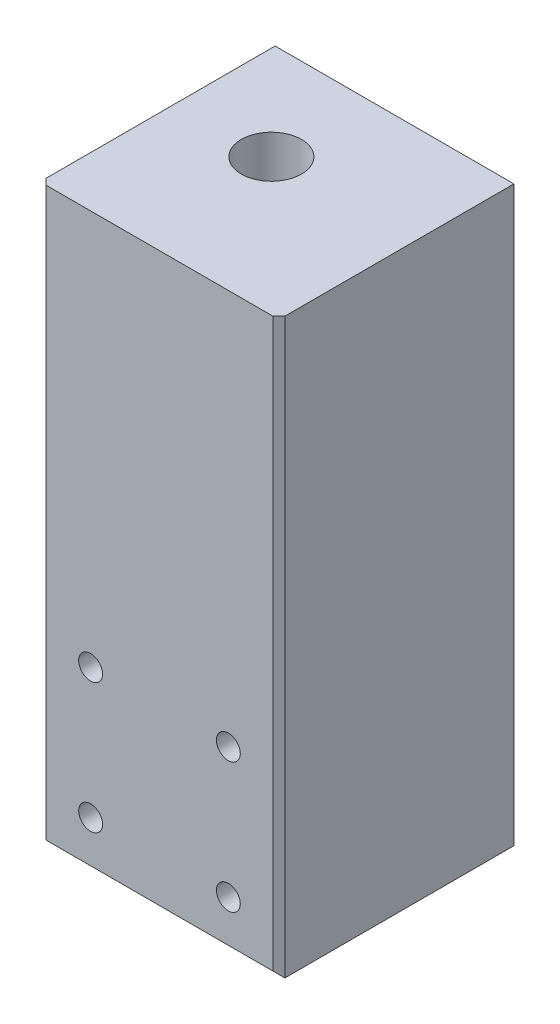
ISO-10303-21;
HEADER;
FILE_DESCRIPTION(('STEP AP214'),'2;1');
FILE_NAME('part.step','',(''),(''),'','','');
FILE_SCHEMA(('AUTOMOTIVE_DESIGN { 1 0 10303 214 1 1 1 1 }'));
ENDSEC;
DATA;
#1=APPLICATION_CONTEXT('core data for automotive mechanical design processes');
#2=APPLICATION_PROTOCOL_DEFINITION('international standard','automotive_design',2000,#1);
#3=PRODUCT_CONTEXT('',#1,'mechanical');
#4=PRODUCT('Part','Part','',(#3));
#5=PRODUCT_RELATED_PRODUCT_CATEGORY('part','',(#4));
#6=PRODUCT_DEFINITION_FORMATION('','',#4);
#7=PRODUCT_DEFINITION_CONTEXT('part definition',#1,'design');
#8=PRODUCT_DEFINITION('design','',#6,#7);
#9=PRODUCT_DEFINITION_SHAPE('','',#8);
#10=(LENGTH_UNIT() NAMED_UNIT(*) SI_UNIT(.MILLI.,.METRE.));
#11=(NAMED_UNIT(*) PLANE_ANGLE_UNIT() SI_UNIT($,.RADIAN.));
#12=(NAMED_UNIT(*) SI_UNIT($,.STERADIAN.) SOLID_ANGLE_UNIT());
#13=UNCERTAINTY_MEASURE_WITH_UNIT(LENGTH_MEASURE(1.E-05),#10,'distance_accuracy_value','');
#14=(GEOMETRIC_REPRESENTATION_CONTEXT(3) GLOBAL_UNCERTAINTY_ASSIGNED_CONTEXT((#13)) GLOBAL_UNIT_ASSIGNED_CONTEXT((#10,
#11,#12)) REPRESENTATION_CONTEXT('',''));
#15=CARTESIAN_POINT('',(0.,0.,0.));
#16=DIRECTION('',(0.,0.,1.));
#17=DIRECTION('',(1.,0.,0.));
#18=AXIS2_PLACEMENT_3D('',#15,#16,#17);
#19=CARTESIAN_POINT('',(-188.874999999999,0.,-25.4));
#20=DIRECTION('',(-1.,0.,0.));
#21=DIRECTION('',(0.,0.,1.));
#22=AXIS2_PLACEMENT_3D('',#19,#20,#21);
#23=PLANE('',#22);
#24=DIRECTION('',(0.,0.,-1.));
#25=VECTOR('',#24,1.);
#26=CARTESIAN_POINT('',(-188.874999999999,0.,-25.4));
#27=LINE('',#26,#25);
#28=CARTESIAN_POINT('',(-188.874999999999,0.,-26.9875));
#29=VERTEX_POINT('',#28);
#30=CARTESIAN_POINT('',(-188.874999999999,0.,-87.9000000000003));
#31=VERTEX_POINT('',#30);
#32=EDGE_CURVE('E92',#29,#31,#27,.T.);
#33=ORIENTED_EDGE('',*,*,#32,.F.);
#34=DIRECTION('',(0.,1.,0.));
#35=VECTOR('',#34,1.);
#36=CARTESIAN_POINT('',(-188.874999999999,0.,-26.9875));
#37=LINE('',#36,#35);
#38=CARTESIAN_POINT('',(-188.874999999999,152.4,-26.9875));
#39=VERTEX_POINT('',#38);
#40=EDGE_CURVE('E11',#29,#39,#37,.T.);
#41=ORIENTED_EDGE('',*,*,#40,.T.);
#42=DIRECTION('',(0.,0.,-1.));
#43=VECTOR('',#42,1.);
#44=CARTESIAN_POINT('',(-188.874999999999,152.4,-25.4));
#45=LINE('',#44,#43);
#46=CARTESIAN_POINT('',(-188.874999999999,152.4,-87.9000000000003));
#47=VERTEX_POINT('',#46);
#48=EDGE_CURVE('E105',#39,#47,#45,.T.);
#49=ORIENTED_EDGE('',*,*,#48,.T.);
#50=DIRECTION('',(0.,1.,0.));
#51=VECTOR('',#50,1.);
#52=CARTESIAN_POINT('',(-188.874999999999,0.,-87.9000000000003));
#53=LINE('',#52,#51);
#54=EDGE_CURVE('E103',#31,#47,#53,.T.);
#55=ORIENTED_EDGE('',*,*,#54,.F.);
#56=EDGE_LOOP('',(#33,#41,#49,#55));
#57=FACE_BOUND('',#56,.T.);
#58=ADVANCED_FACE('F39',(#57),#23,.T.);
#59=CARTESIAN_POINT('',(0.,0.,-25.4));
#60=DIRECTION('',(0.,-1.,0.));
#61=DIRECTION('',(0.,0.,-1.));
#62=AXIS2_PLACEMENT_3D('',#59,#60,#61);
#63=PLANE('',#62);
#64=CARTESIAN_POINT('',(-163.875000000012,0.,-61.9000000000001));
#65=DIRECTION('',(0.,-1.,0.));
#66=DIRECTION('',(0.,0.,-1.));
#67=AXIS2_PLACEMENT_3D('',#64,#65,#66);
#68=CIRCLE('',#67,8.00000000000001);
#69=CARTESIAN_POINT('',(-163.875000000012,0.,-69.9000000000001));
#70=VERTEX_POINT('',#69);
#71=EDGE_CURVE('E336',#70,#70,#68,.T.);
#72=ORIENTED_EDGE('',*,*,#71,.F.);
#73=EDGE_LOOP('',(#72));
#74=FACE_BOUND('',#73,.T.);
#75=CARTESIAN_POINT('',(-163.875000000012,0.,-80.9000000000001));
#76=DIRECTION('',(0.,-1.,0.));
#77=DIRECTION('',(0.,0.,-1.));
#78=AXIS2_PLACEMENT_3D('',#75,#76,#77);
#79=CIRCLE('',#78,2.75);
#80=CARTESIAN_POINT('',(-163.875000000012,0.,-83.6500000000001));
#81=VERTEX_POINT('',#80);
#82=EDGE_CURVE('E348',#81,#81,#79,.T.);
#83=ORIENTED_EDGE('',*,*,#82,.F.);
#84=EDGE_LOOP('',(#83));
#85=FACE_BOUND('',#84,.T.);
#86=CARTESIAN_POINT('',(-177.310028842556,0.,-75.3350288425446));
#87=DIRECTION('',(0.,-1.,0.));
#88=DIRECTION('',(0.,0.,-1.));
#89=AXIS2_PLACEMENT_3D('',#86,#87,#88);
#90=CIRCLE('',#89,2.75000000000003);
#91=CARTESIAN_POINT('',(-177.310028842556,0.,-78.0850288425446));
#92=VERTEX_POINT('',#91);
#93=EDGE_CURVE('E354',#92,#92,#90,.T.);
#94=ORIENTED_EDGE('',*,*,#93,.F.);
#95=EDGE_LOOP('',(#94));
#96=FACE_BOUND('',#95,.T.);
#97=CARTESIAN_POINT('',(-150.439971157467,0.,-48.4649711574556));
#98=DIRECTION('',(0.,-1.,0.));
#99=DIRECTION('',(0.,0.,-1.));
#100=AXIS2_PLACEMENT_3D('',#97,#98,#99);
#101=CIRCLE('',#100,2.75);
#102=CARTESIAN_POINT('',(-150.439971157467,0.,-51.2149711574556));
#103=VERTEX_POINT('',#102);
#104=EDGE_CURVE('E360',#103,#103,#101,.T.);
#105=ORIENTED_EDGE('',*,*,#104,.F.);
#106=EDGE_LOOP('',(#105));
#107=FACE_BOUND('',#106,.T.);
#108=CARTESIAN_POINT('',(-163.875000000012,0.,-42.9000000000001));
#109=DIRECTION('',(0.,-1.,0.));
#110=DIRECTION('',(0.,0.,-1.));
#111=AXIS2_PLACEMENT_3D('',#108,#109,#110);
#112=CIRCLE('',#111,2.75);
#113=CARTESIAN_POINT('',(-163.875000000012,0.,-45.6500000000001));
#114=VERTEX_POINT('',#113);
#115=EDGE_CURVE('E154',#114,#114,#112,.T.);
#116=ORIENTED_EDGE('',*,*,#115,.F.);
#117=EDGE_LOOP('',(#116));
#118=FACE_BOUND('',#117,.T.);
#119=CARTESIAN_POINT('',(-177.310028842556,0.,-48.4649711574556));
#120=DIRECTION('',(0.,-1.,0.));
#121=DIRECTION('',(0.,0.,-1.));
#122=AXIS2_PLACEMENT_3D('',#119,#120,#121);
#123=CIRCLE('',#122,2.75000000000003);
#124=CARTESIAN_POINT('',(-177.310028842556,0.,-51.2149711574556));
#125=VERTEX_POINT('',#124);
#126=EDGE_CURVE('E338',#125,#125,#123,.T.);
#127=ORIENTED_EDGE('',*,*,#126,.F.);
#128=EDGE_LOOP('',(#127));
#129=FACE_BOUND('',#128,.T.);
#130=CARTESIAN_POINT('',(-150.439971157467,0.,-75.3350288425446));
#131=DIRECTION('',(0.,-1.,0.));
#132=DIRECTION('',(0.,0.,-1.));
#133=AXIS2_PLACEMENT_3D('',#130,#131,#132);
#134=CIRCLE('',#133,2.75);
#135=CARTESIAN_POINT('',(-150.439971157467,0.,-78.0850288425446));
#136=VERTEX_POINT('',#135);
#137=EDGE_CURVE('E146',#136,#136,#134,.T.);
#138=ORIENTED_EDGE('',*,*,#137,.F.);
#139=EDGE_LOOP('',(#138));
#140=FACE_BOUND('',#139,.T.);
#141=DIRECTION('',(0.,0.,-1.));
#142=VECTOR('',#141,1.);
#143=CARTESIAN_POINT('',(-125.374999999999,0.,-25.4));
#144=LINE('',#143,#142);
#145=CARTESIAN_POINT('',(-125.374999999999,0.,-26.9875));
#146=VERTEX_POINT('',#145);
#147=CARTESIAN_POINT('',(-125.374999999999,0.,-87.9000000000003));
#148=VERTEX_POINT('',#147);
#149=EDGE_CURVE('E100',#146,#148,#144,.T.);
#150=ORIENTED_EDGE('',*,*,#149,.F.);
#151=DIRECTION('',(-1.,0.,0.));
#152=VECTOR('',#151,1.);
#153=CARTESIAN_POINT('',(0.,0.,-26.9875));
#154=LINE('',#153,#152);
#155=EDGE_CURVE('E49',#146,#29,#154,.T.);
#156=ORIENTED_EDGE('',*,*,#155,.T.);
#157=ORIENTED_EDGE('',*,*,#32,.T.);
#158=DIRECTION('',(-1.,0.,0.));
#159=VECTOR('',#158,1.);
#160=CARTESIAN_POINT('',(0.,0.,-87.9000000000003));
#161=LINE('',#160,#159);
#162=EDGE_CURVE('E96',#148,#31,#161,.T.);
#163=ORIENTED_EDGE('',*,*,#162,.F.);
#164=EDGE_LOOP('',(#150,#156,#157,#163));
#165=FACE_BOUND('',#164,.T.);
#166=ADVANCED_FACE('F94',(#74,#85,#96,#107,#118,#129,#140,#165),#63,.T.);
#167=CARTESIAN_POINT('',(-125.374999999999,0.,-25.4));
#168=DIRECTION('',(-1.,0.,0.));
#169=DIRECTION('',(0.,0.,1.));
#170=AXIS2_PLACEMENT_3D('',#167,#168,#169);
#171=PLANE('',#170);
#172=DIRECTION('',(0.,0.,-1.));
#173=VECTOR('',#172,1.);
#174=CARTESIAN_POINT('',(-125.374999999999,152.4,-25.4));
#175=LINE('',#174,#173);
#176=CARTESIAN_POINT('',(-125.374999999999,152.4,-26.9875));
#177=VERTEX_POINT('',#176);
#178=CARTESIAN_POINT('',(-125.374999999999,152.4,-87.9000000000003));
#179=VERTEX_POINT('',#178);
#180=EDGE_CURVE('E123',#177,#179,#175,.T.);
#181=ORIENTED_EDGE('',*,*,#180,.F.);
#182=DIRECTION('',(0.,-1.,0.));
#183=VECTOR('',#182,1.);
#184=CARTESIAN_POINT('',(-125.374999999999,0.,-26.9875));
#185=LINE('',#184,#183);
#186=EDGE_CURVE('E64',#177,#146,#185,.T.);
#187=ORIENTED_EDGE('',*,*,#186,.T.);
#188=ORIENTED_EDGE('',*,*,#149,.T.);
#189=DIRECTION('',(0.,1.,0.));
#190=VECTOR('',#189,1.);
#191=CARTESIAN_POINT('',(-125.374999999999,0.,-87.9000000000003));
#192=LINE('',#191,#190);
#193=EDGE_CURVE('E114',#148,#179,#192,.T.);
#194=ORIENTED_EDGE('',*,*,#193,.T.);
#195=EDGE_LOOP('',(#181,#187,#188,#194));
#196=FACE_BOUND('',#195,.T.);
#197=ADVANCED_FACE('F220',(#196),#171,.F.);
#198=CARTESIAN_POINT('',(0.,152.4,-25.4));
#199=DIRECTION('',(0.,1.,0.));
#200=DIRECTION('',(0.,0.,1.));
#201=AXIS2_PLACEMENT_3D('',#198,#199,#200);
#202=PLANE('',#201);
#203=CARTESIAN_POINT('',(-163.875000000012,152.4,-61.9000000000001));
#204=DIRECTION('',(0.,-1.,0.));
#205=DIRECTION('',(0.,0.,-1.));
#206=AXIS2_PLACEMENT_3D('',#203,#204,#205);
#207=CIRCLE('',#206,8.00000000000001);
#208=CARTESIAN_POINT('',(-163.875000000012,152.4,-69.9000000000001));
#209=VERTEX_POINT('',#208);
#210=EDGE_CURVE('E333',#209,#209,#207,.T.);
#211=ORIENTED_EDGE('',*,*,#210,.T.);
#212=EDGE_LOOP('',(#211));
#213=FACE_BOUND('',#212,.T.);
#214=DIRECTION('',(1.,0.,0.));
#215=VECTOR('',#214,1.);
#216=CARTESIAN_POINT('',(0.,152.4,-25.4));
#217=LINE('',#216,#215);
#218=CARTESIAN_POINT('',(-187.287499999999,152.4,-25.4));
#219=VERTEX_POINT('',#218);
#220=CARTESIAN_POINT('',(-126.962499999999,152.4,-25.4));
#221=VERTEX_POINT('',#220);
#222=EDGE_CURVE('E121',#219,#221,#217,.T.);
#223=ORIENTED_EDGE('',*,*,#222,.T.);
#224=DIRECTION('',(0.707106781186549,0.,-0.707106781186546));
#225=VECTOR('',#224,1.);
#226=CARTESIAN_POINT('',(-63.4812499999994,152.4,-88.8812499999997));
#227=LINE('',#226,#225);
#228=EDGE_CURVE('E134',#221,#177,#227,.T.);
#229=ORIENTED_EDGE('',*,*,#228,.T.);
#230=ORIENTED_EDGE('',*,*,#180,.T.);
#231=DIRECTION('',(1.,0.,0.));
#232=VECTOR('',#231,1.);
#233=CARTESIAN_POINT('',(0.,152.4,-87.9000000000003));
#234=LINE('',#233,#232);
#235=EDGE_CURVE('E116',#47,#179,#234,.T.);
#236=ORIENTED_EDGE('',*,*,#235,.F.);
#237=ORIENTED_EDGE('',*,*,#48,.F.);
#238=DIRECTION('',(-0.707106781186549,0.,-0.707106781186546));
#239=VECTOR('',#238,1.);
#240=CARTESIAN_POINT('',(-93.6437499999993,152.4,68.2437499999997));
#241=LINE('',#240,#239);
#242=EDGE_CURVE('E132',#39,#219,#241,.F.);
#243=ORIENTED_EDGE('',*,*,#242,.T.);
#244=EDGE_LOOP('',(#223,#229,#230,#236,#237,#243));
#245=FACE_BOUND('',#244,.T.);
#246=ADVANCED_FACE('F193',(#213,#245),#202,.T.);
#247=CARTESIAN_POINT('',(0.,0.,-25.4));
#248=DIRECTION('',(0.,0.,1.));
#249=DIRECTION('',(1.,0.,0.));
#250=AXIS2_PLACEMENT_3D('',#247,#248,#249);
#251=PLANE('',#250);
#252=CARTESIAN_POINT('',(-138.815833333333,12.7,-25.4));
#253=DIRECTION('',(0.,0.,1.));
#254=DIRECTION('',(1.,0.,0.));
#255=AXIS2_PLACEMENT_3D('',#252,#253,#254);
#256=CIRCLE('',#255,3.175);
#257=CARTESIAN_POINT('',(-135.640833333333,12.7,-25.4));
#258=VERTEX_POINT('',#257);
#259=EDGE_CURVE('E172',#258,#258,#256,.T.);
#260=ORIENTED_EDGE('',*,*,#259,.F.);
#261=EDGE_LOOP('',(#260));
#262=FACE_BOUND('',#261,.T.);
#263=CARTESIAN_POINT('',(-175.434166666666,12.7,-25.4));
#264=DIRECTION('',(0.,0.,1.));
#265=DIRECTION('',(1.,0.,0.));
#266=AXIS2_PLACEMENT_3D('',#263,#264,#265);
#267=CIRCLE('',#266,3.175);
#268=CARTESIAN_POINT('',(-172.259166666666,12.7,-25.4));
#269=VERTEX_POINT('',#268);
#270=EDGE_CURVE('E173',#269,#269,#267,.T.);
#271=ORIENTED_EDGE('',*,*,#270,.F.);
#272=EDGE_LOOP('',(#271));
#273=FACE_BOUND('',#272,.T.);
#274=CARTESIAN_POINT('',(-175.434166666666,47.3000000000001,-25.4));
#275=DIRECTION('',(0.,0.,1.));
#276=DIRECTION('',(1.,0.,0.));
#277=AXIS2_PLACEMENT_3D('',#274,#275,#276);
#278=CIRCLE('',#277,3.175);
#279=CARTESIAN_POINT('',(-172.259166666666,47.3000000000001,-25.4));
#280=VERTEX_POINT('',#279);
#281=EDGE_CURVE('E160',#280,#280,#278,.T.);
#282=ORIENTED_EDGE('',*,*,#281,.F.);
#283=EDGE_LOOP('',(#282));
#284=FACE_BOUND('',#283,.T.);
#285=CARTESIAN_POINT('',(-138.815833333333,47.3000000000001,-25.4));
#286=DIRECTION('',(0.,0.,1.));
#287=DIRECTION('',(1.,0.,0.));
#288=AXIS2_PLACEMENT_3D('',#285,#286,#287);
#289=CIRCLE('',#288,3.175);
#290=CARTESIAN_POINT('',(-135.640833333333,47.3000000000001,-25.4));
#291=VERTEX_POINT('',#290);
#292=EDGE_CURVE('E184',#291,#291,#289,.T.);
#293=ORIENTED_EDGE('',*,*,#292,.F.);
#294=EDGE_LOOP('',(#293));
#295=FACE_BOUND('',#294,.T.);
#296=DIRECTION('',(1.,0.,0.));
#297=VECTOR('',#296,1.);
#298=CARTESIAN_POINT('',(0.,1.58750000000003,-25.4));
#299=LINE('',#298,#297);
#300=CARTESIAN_POINT('',(-187.287499999999,1.58750000000003,-25.4));
#301=VERTEX_POINT('',#300);
#302=CARTESIAN_POINT('',(-126.962499999999,1.58750000000003,-25.4));
#303=VERTEX_POINT('',#302);
#304=EDGE_CURVE('E127',#301,#303,#299,.T.);
#305=ORIENTED_EDGE('',*,*,#304,.T.);
#306=DIRECTION('',(0.,1.,0.));
#307=VECTOR('',#306,1.);
#308=CARTESIAN_POINT('',(-126.962499999999,152.4,-25.4));
#309=LINE('',#308,#307);
#310=EDGE_CURVE('E129',#303,#221,#309,.T.);
#311=ORIENTED_EDGE('',*,*,#310,.T.);
#312=ORIENTED_EDGE('',*,*,#222,.F.);
#313=DIRECTION('',(0.,-1.,0.));
#314=VECTOR('',#313,1.);
#315=CARTESIAN_POINT('',(-187.287499999999,0.,-25.4));
#316=LINE('',#315,#314);
#317=EDGE_CURVE('E99',#219,#301,#316,.T.);
#318=ORIENTED_EDGE('',*,*,#317,.T.);
#319=EDGE_LOOP('',(#305,#311,#312,#318));
#320=FACE_BOUND('',#319,.T.);
#321=ADVANCED_FACE('F197',(#262,#273,#284,#295,#320),#251,.T.);
#322=CARTESIAN_POINT('',(0.,0.,-87.9000000000003));
#323=DIRECTION('',(0.,0.,1.));
#324=DIRECTION('',(1.,0.,0.));
#325=AXIS2_PLACEMENT_3D('',#322,#323,#324);
#326=PLANE('',#325);
#327=CARTESIAN_POINT('',(-138.815833333333,47.3000000000001,-87.9000000000003));
#328=DIRECTION('',(0.,0.,1.));
#329=DIRECTION('',(1.,0.,0.));
#330=AXIS2_PLACEMENT_3D('',#327,#328,#329);
#331=CIRCLE('',#330,3.175);
#332=CARTESIAN_POINT('',(-135.640833333333,47.3000000000001,-87.9000000000003));
#333=VERTEX_POINT('',#332);
#334=EDGE_CURVE('E161',#333,#333,#331,.T.);
#335=ORIENTED_EDGE('',*,*,#334,.T.);
#336=EDGE_LOOP('',(#335));
#337=FACE_BOUND('',#336,.T.);
#338=CARTESIAN_POINT('',(-138.815833333333,12.7,-87.9000000000003));
#339=DIRECTION('',(0.,0.,1.));
#340=DIRECTION('',(1.,0.,0.));
#341=AXIS2_PLACEMENT_3D('',#338,#339,#340);
#342=CIRCLE('',#341,3.175);
#343=CARTESIAN_POINT('',(-135.640833333333,12.7,-87.9000000000003));
#344=VERTEX_POINT('',#343);
#345=EDGE_CURVE('E144',#344,#344,#342,.T.);
#346=ORIENTED_EDGE('',*,*,#345,.T.);
#347=EDGE_LOOP('',(#346));
#348=FACE_BOUND('',#347,.T.);
#349=ORIENTED_EDGE('',*,*,#54,.T.);
#350=ORIENTED_EDGE('',*,*,#235,.T.);
#351=ORIENTED_EDGE('',*,*,#193,.F.);
#352=ORIENTED_EDGE('',*,*,#162,.T.);
#353=EDGE_LOOP('',(#349,#350,#351,#352));
#354=FACE_BOUND('',#353,.T.);
#355=ADVANCED_FACE('F112',(#337,#348,#354),#326,.F.);
#356=CARTESIAN_POINT('',(-138.815833333333,47.3000000000001,-50.8));
#357=DIRECTION('',(0.,0.,1.));
#358=DIRECTION('',(1.,0.,0.));
#359=AXIS2_PLACEMENT_3D('',#356,#357,#358);
#360=CYLINDRICAL_SURFACE('',#359,3.175);
#361=CARTESIAN_POINT('',(-138.815833333333,47.3000000000001,-50.8));
#362=DIRECTION('',(0.,0.,1.));
#363=DIRECTION('',(1.,0.,0.));
#364=AXIS2_PLACEMENT_3D('',#361,#362,#363);
#365=CIRCLE('',#364,3.175);
#366=CARTESIAN_POINT('',(-135.640833333333,47.3000000000001,-50.8));
#367=VERTEX_POINT('',#366);
#368=EDGE_CURVE('E109',#367,#367,#365,.T.);
#369=ORIENTED_EDGE('',*,*,#368,.F.);
#370=EDGE_LOOP('',(#369));
#371=FACE_BOUND('',#370,.T.);
#372=ORIENTED_EDGE('',*,*,#292,.T.);
#373=EDGE_LOOP('',(#372));
#374=FACE_BOUND('',#373,.T.);
#375=ADVANCED_FACE('F231',(#371,#374),#360,.F.);
#376=CARTESIAN_POINT('',(-138.815833333333,47.3000000000001,-50.8));
#377=DIRECTION('',(0.,0.,1.));
#378=DIRECTION('',(1.,0.,0.));
#379=AXIS2_PLACEMENT_3D('',#376,#377,#378);
#380=PLANE('',#379);
#381=ORIENTED_EDGE('',*,*,#368,.T.);
#382=EDGE_LOOP('',(#381));
#383=FACE_BOUND('',#382,.T.);
#384=ADVANCED_FACE('F238',(#383),#380,.T.);
#385=CARTESIAN_POINT('',(-175.434166666666,47.3000000000001,-50.8));
#386=DIRECTION('',(0.,0.,1.));
#387=DIRECTION('',(1.,0.,0.));
#388=AXIS2_PLACEMENT_3D('',#385,#386,#387);
#389=CYLINDRICAL_SURFACE('',#388,3.175);
#390=CARTESIAN_POINT('',(-175.434166666666,47.3000000000001,-50.8));
#391=DIRECTION('',(0.,0.,1.));
#392=DIRECTION('',(1.,0.,0.));
#393=AXIS2_PLACEMENT_3D('',#390,#391,#392);
#394=CIRCLE('',#393,3.175);
#395=CARTESIAN_POINT('',(-172.259166666666,47.3000000000001,-50.8));
#396=VERTEX_POINT('',#395);
#397=EDGE_CURVE('E176',#396,#396,#394,.T.);
#398=ORIENTED_EDGE('',*,*,#397,.F.);
#399=EDGE_LOOP('',(#398));
#400=FACE_BOUND('',#399,.T.);
#401=ORIENTED_EDGE('',*,*,#281,.T.);
#402=EDGE_LOOP('',(#401));
#403=FACE_BOUND('',#402,.T.);
#404=ADVANCED_FACE('F242',(#400,#403),#389,.F.);
#405=CARTESIAN_POINT('',(-175.434166666666,47.3000000000001,-50.8));
#406=DIRECTION('',(0.,0.,1.));
#407=DIRECTION('',(1.,0.,0.));
#408=AXIS2_PLACEMENT_3D('',#405,#406,#407);
#409=PLANE('',#408);
#410=ORIENTED_EDGE('',*,*,#397,.T.);
#411=EDGE_LOOP('',(#410));
#412=FACE_BOUND('',#411,.T.);
#413=ADVANCED_FACE('F256',(#412),#409,.T.);
#414=CARTESIAN_POINT('',(-175.434166666666,12.7,-50.8));
#415=DIRECTION('',(0.,0.,1.));
#416=DIRECTION('',(1.,0.,0.));
#417=AXIS2_PLACEMENT_3D('',#414,#415,#416);
#418=CYLINDRICAL_SURFACE('',#417,3.175);
#419=CARTESIAN_POINT('',(-175.434166666666,12.7,-50.8));
#420=DIRECTION('',(0.,0.,1.));
#421=DIRECTION('',(1.,0.,0.));
#422=AXIS2_PLACEMENT_3D('',#419,#420,#421);
#423=CIRCLE('',#422,3.175);
#424=CARTESIAN_POINT('',(-172.259166666666,12.7,-50.8));
#425=VERTEX_POINT('',#424);
#426=EDGE_CURVE('E169',#425,#425,#423,.T.);
#427=ORIENTED_EDGE('',*,*,#426,.F.);
#428=EDGE_LOOP('',(#427));
#429=FACE_BOUND('',#428,.T.);
#430=ORIENTED_EDGE('',*,*,#270,.T.);
#431=EDGE_LOOP('',(#430));
#432=FACE_BOUND('',#431,.T.);
#433=ADVANCED_FACE('F260',(#429,#432),#418,.F.);
#434=CARTESIAN_POINT('',(-175.434166666666,12.7,-50.8));
#435=DIRECTION('',(0.,0.,1.));
#436=DIRECTION('',(1.,0.,0.));
#437=AXIS2_PLACEMENT_3D('',#434,#435,#436);
#438=PLANE('',#437);
#439=ORIENTED_EDGE('',*,*,#426,.T.);
#440=EDGE_LOOP('',(#439));
#441=FACE_BOUND('',#440,.T.);
#442=ADVANCED_FACE('F248',(#441),#438,.T.);
#443=CARTESIAN_POINT('',(-138.815833333333,12.7,-50.8));
#444=DIRECTION('',(0.,0.,1.));
#445=DIRECTION('',(1.,0.,0.));
#446=AXIS2_PLACEMENT_3D('',#443,#444,#445);
#447=CYLINDRICAL_SURFACE('',#446,3.175);
#448=CARTESIAN_POINT('',(-138.815833333333,12.7,-50.8));
#449=DIRECTION('',(0.,0.,1.));
#450=DIRECTION('',(1.,0.,0.));
#451=AXIS2_PLACEMENT_3D('',#448,#449,#450);
#452=CIRCLE('',#451,3.175);
#453=CARTESIAN_POINT('',(-135.640833333333,12.7,-50.8));
#454=VERTEX_POINT('',#453);
#455=EDGE_CURVE('E181',#454,#454,#452,.T.);
#456=ORIENTED_EDGE('',*,*,#455,.F.);
#457=EDGE_LOOP('',(#456));
#458=FACE_BOUND('',#457,.T.);
#459=ORIENTED_EDGE('',*,*,#259,.T.);
#460=EDGE_LOOP('',(#459));
#461=FACE_BOUND('',#460,.T.);
#462=ADVANCED_FACE('F244',(#458,#461),#447,.F.);
#463=CARTESIAN_POINT('',(-138.815833333333,12.7,-50.8));
#464=DIRECTION('',(0.,0.,1.));
#465=DIRECTION('',(1.,0.,0.));
#466=AXIS2_PLACEMENT_3D('',#463,#464,#465);
#467=PLANE('',#466);
#468=ORIENTED_EDGE('',*,*,#455,.T.);
#469=EDGE_LOOP('',(#468));
#470=FACE_BOUND('',#469,.T.);
#471=ADVANCED_FACE('F247',(#470),#467,.T.);
#472=CARTESIAN_POINT('',(-138.815833333333,12.7,-81.5500000000003));
#473=DIRECTION('',(0.,0.,-1.));
#474=DIRECTION('',(-1.,0.,0.));
#475=AXIS2_PLACEMENT_3D('',#472,#473,#474);
#476=CYLINDRICAL_SURFACE('',#475,3.175);
#477=CARTESIAN_POINT('',(-138.815833333333,12.7,-81.5500000000003));
#478=DIRECTION('',(0.,0.,1.));
#479=DIRECTION('',(1.,0.,0.));
#480=AXIS2_PLACEMENT_3D('',#477,#478,#479);
#481=CIRCLE('',#480,3.175);
#482=CARTESIAN_POINT('',(-135.640833333333,12.7,-81.5500000000003));
#483=VERTEX_POINT('',#482);
#484=EDGE_CURVE('E164',#483,#483,#481,.T.);
#485=ORIENTED_EDGE('',*,*,#484,.T.);
#486=EDGE_LOOP('',(#485));
#487=FACE_BOUND('',#486,.T.);
#488=ORIENTED_EDGE('',*,*,#345,.F.);
#489=EDGE_LOOP('',(#488));
#490=FACE_BOUND('',#489,.T.);
#491=ADVANCED_FACE('F252',(#487,#490),#476,.F.);
#492=CARTESIAN_POINT('',(-138.815833333333,12.7,-81.5500000000003));
#493=DIRECTION('',(0.,0.,1.));
#494=DIRECTION('',(1.,0.,0.));
#495=AXIS2_PLACEMENT_3D('',#492,#493,#494);
#496=PLANE('',#495);
#497=ORIENTED_EDGE('',*,*,#484,.F.);
#498=EDGE_LOOP('',(#497));
#499=FACE_BOUND('',#498,.T.);
#500=ADVANCED_FACE('F270',(#499),#496,.F.);
#501=CARTESIAN_POINT('',(-138.815833333333,47.3000000000001,-81.5500000000003));
#502=DIRECTION('',(0.,0.,-1.));
#503=DIRECTION('',(-1.,0.,0.));
#504=AXIS2_PLACEMENT_3D('',#501,#502,#503);
#505=CYLINDRICAL_SURFACE('',#504,3.175);
#506=CARTESIAN_POINT('',(-138.815833333333,47.3000000000001,-81.5500000000003));
#507=DIRECTION('',(0.,0.,1.));
#508=DIRECTION('',(1.,0.,0.));
#509=AXIS2_PLACEMENT_3D('',#506,#507,#508);
#510=CIRCLE('',#509,3.175);
#511=CARTESIAN_POINT('',(-135.640833333333,47.3000000000001,-81.5500000000003));
#512=VERTEX_POINT('',#511);
#513=EDGE_CURVE('E157',#512,#512,#510,.T.);
#514=ORIENTED_EDGE('',*,*,#513,.T.);
#515=EDGE_LOOP('',(#514));
#516=FACE_BOUND('',#515,.T.);
#517=ORIENTED_EDGE('',*,*,#334,.F.);
#518=EDGE_LOOP('',(#517));
#519=FACE_BOUND('',#518,.T.);
#520=ADVANCED_FACE('F274',(#516,#519),#505,.F.);
#521=CARTESIAN_POINT('',(-138.815833333333,47.3000000000001,-81.5500000000003));
#522=DIRECTION('',(0.,0.,1.));
#523=DIRECTION('',(1.,0.,0.));
#524=AXIS2_PLACEMENT_3D('',#521,#522,#523);
#525=PLANE('',#524);
#526=ORIENTED_EDGE('',*,*,#513,.F.);
#527=EDGE_LOOP('',(#526));
#528=FACE_BOUND('',#527,.T.);
#529=ADVANCED_FACE('F278',(#528),#525,.F.);
#530=CARTESIAN_POINT('',(-188.874999999999,0.,-26.9875));
#531=DIRECTION('',(0.707106781186546,0.,-0.707106781186549));
#532=DIRECTION('',(0.,1.,0.));
#533=AXIS2_PLACEMENT_3D('',#530,#531,#532);
#534=PLANE('',#533);
#535=ORIENTED_EDGE('',*,*,#242,.F.);
#536=ORIENTED_EDGE('',*,*,#40,.F.);
#537=DIRECTION('',(0.577350269189626,0.577350269189629,0.577350269189623));
#538=VECTOR('',#537,1.);
#539=CARTESIAN_POINT('',(-188.874999999999,0.,-26.9875));
#540=LINE('',#539,#538);
#541=EDGE_CURVE('E44',#301,#29,#540,.F.);
#542=ORIENTED_EDGE('',*,*,#541,.F.);
#543=ORIENTED_EDGE('',*,*,#317,.F.);
#544=EDGE_LOOP('',(#535,#536,#542,#543));
#545=FACE_BOUND('',#544,.T.);
#546=ADVANCED_FACE('F42',(#545),#534,.F.);
#547=CARTESIAN_POINT('',(0.,0.,-26.9875));
#548=DIRECTION('',(0.,0.707106781186544,-0.707106781186551));
#549=DIRECTION('',(-1.,0.,0.));
#550=AXIS2_PLACEMENT_3D('',#547,#548,#549);
#551=PLANE('',#550);
#552=ORIENTED_EDGE('',*,*,#541,.T.);
#553=ORIENTED_EDGE('',*,*,#155,.F.);
#554=DIRECTION('',(0.577350269189626,-0.577350269189629,-0.577350269189623));
#555=VECTOR('',#554,1.);
#556=CARTESIAN_POINT('',(-83.5833333333329,-41.7916666666667,-68.7791666666663));
#557=LINE('',#556,#555);
#558=EDGE_CURVE('E137',#303,#146,#557,.T.);
#559=ORIENTED_EDGE('',*,*,#558,.F.);
#560=ORIENTED_EDGE('',*,*,#304,.F.);
#561=EDGE_LOOP('',(#552,#553,#559,#560));
#562=FACE_BOUND('',#561,.T.);
#563=ADVANCED_FACE('F202',(#562),#551,.F.);
#564=CARTESIAN_POINT('',(-126.962499999999,0.,-25.4));
#565=DIRECTION('',(0.707106781186546,0.,0.707106781186549));
#566=DIRECTION('',(0.,-1.,0.));
#567=AXIS2_PLACEMENT_3D('',#564,#565,#566);
#568=PLANE('',#567);
#569=ORIENTED_EDGE('',*,*,#558,.T.);
#570=ORIENTED_EDGE('',*,*,#186,.F.);
#571=ORIENTED_EDGE('',*,*,#228,.F.);
#572=ORIENTED_EDGE('',*,*,#310,.F.);
#573=EDGE_LOOP('',(#569,#570,#571,#572));
#574=FACE_BOUND('',#573,.T.);
#575=ADVANCED_FACE('F203',(#574),#568,.T.);
#576=CARTESIAN_POINT('',(-150.439971157467,6.35,-75.3350288425446));
#577=DIRECTION('',(0.,-1.,0.));
#578=DIRECTION('',(0.,0.,-1.));
#579=AXIS2_PLACEMENT_3D('',#576,#577,#578);
#580=CYLINDRICAL_SURFACE('',#579,2.75);
#581=CARTESIAN_POINT('',(-150.439971157467,6.35,-75.3350288425446));
#582=DIRECTION('',(0.,-1.,0.));
#583=DIRECTION('',(0.,0.,-1.));
#584=AXIS2_PLACEMENT_3D('',#581,#582,#583);
#585=CIRCLE('',#584,2.75);
#586=CARTESIAN_POINT('',(-150.439971157467,6.35,-78.0850288425446));
#587=VERTEX_POINT('',#586);
#588=EDGE_CURVE('E139',#587,#587,#585,.T.);
#589=ORIENTED_EDGE('',*,*,#588,.F.);
#590=EDGE_LOOP('',(#589));
#591=FACE_BOUND('',#590,.T.);
#592=ORIENTED_EDGE('',*,*,#137,.T.);
#593=EDGE_LOOP('',(#592));
#594=FACE_BOUND('',#593,.T.);
#595=ADVANCED_FACE('F205',(#591,#594),#580,.F.);
#596=CARTESIAN_POINT('',(0.,6.35,0.));
#597=DIRECTION('',(0.,-1.,0.));
#598=DIRECTION('',(0.,0.,-1.));
#599=AXIS2_PLACEMENT_3D('',#596,#597,#598);
#600=PLANE('',#599);
#601=ORIENTED_EDGE('',*,*,#588,.T.);
#602=EDGE_LOOP('',(#601));
#603=FACE_BOUND('',#602,.T.);
#604=ADVANCED_FACE('F211',(#603),#600,.T.);
#605=CARTESIAN_POINT('',(-177.310028842556,6.35,-48.4649711574556));
#606=DIRECTION('',(0.,-1.,0.));
#607=DIRECTION('',(0.,0.,-1.));
#608=AXIS2_PLACEMENT_3D('',#605,#606,#607);
#609=CYLINDRICAL_SURFACE('',#608,2.75000000000003);
#610=CARTESIAN_POINT('',(-177.310028842556,6.35,-48.4649711574556));
#611=DIRECTION('',(0.,-1.,0.));
#612=DIRECTION('',(0.,0.,-1.));
#613=AXIS2_PLACEMENT_3D('',#610,#611,#612);
#614=CIRCLE('',#613,2.75000000000003);
#615=CARTESIAN_POINT('',(-177.310028842556,6.35,-51.2149711574556));
#616=VERTEX_POINT('',#615);
#617=EDGE_CURVE('E341',#616,#616,#614,.T.);
#618=ORIENTED_EDGE('',*,*,#617,.F.);
#619=EDGE_LOOP('',(#618));
#620=FACE_BOUND('',#619,.T.);
#621=ORIENTED_EDGE('',*,*,#126,.T.);
#622=EDGE_LOOP('',(#621));
#623=FACE_BOUND('',#622,.T.);
#624=ADVANCED_FACE('F285',(#620,#623),#609,.F.);
#625=CARTESIAN_POINT('',(0.,6.35,0.));
#626=DIRECTION('',(0.,-1.,0.));
#627=DIRECTION('',(0.,0.,-1.));
#628=AXIS2_PLACEMENT_3D('',#625,#626,#627);
#629=PLANE('',#628);
#630=ORIENTED_EDGE('',*,*,#617,.T.);
#631=EDGE_LOOP('',(#630));
#632=FACE_BOUND('',#631,.T.);
#633=ADVANCED_FACE('F290',(#632),#629,.T.);
#634=CARTESIAN_POINT('',(-163.875000000012,6.35,-42.9000000000001));
#635=DIRECTION('',(0.,-1.,0.));
#636=DIRECTION('',(0.,0.,-1.));
#637=AXIS2_PLACEMENT_3D('',#634,#635,#636);
#638=CYLINDRICAL_SURFACE('',#637,2.75);
#639=CARTESIAN_POINT('',(-163.875000000012,6.35,-42.9000000000001));
#640=DIRECTION('',(0.,-1.,0.));
#641=DIRECTION('',(0.,0.,-1.));
#642=AXIS2_PLACEMENT_3D('',#639,#640,#641);
#643=CIRCLE('',#642,2.75);
#644=CARTESIAN_POINT('',(-163.875000000012,6.35,-45.6500000000001));
#645=VERTEX_POINT('',#644);
#646=EDGE_CURVE('E362',#645,#645,#643,.T.);
#647=ORIENTED_EDGE('',*,*,#646,.F.);
#648=EDGE_LOOP('',(#647));
#649=FACE_BOUND('',#648,.T.);
#650=ORIENTED_EDGE('',*,*,#115,.T.);
#651=EDGE_LOOP('',(#650));
#652=FACE_BOUND('',#651,.T.);
#653=ADVANCED_FACE('F286',(#649,#652),#638,.F.);
#654=CARTESIAN_POINT('',(0.,6.35,0.));
#655=DIRECTION('',(0.,-1.,0.));
#656=DIRECTION('',(0.,0.,-1.));
#657=AXIS2_PLACEMENT_3D('',#654,#655,#656);
#658=PLANE('',#657);
#659=ORIENTED_EDGE('',*,*,#646,.T.);
#660=EDGE_LOOP('',(#659));
#661=FACE_BOUND('',#660,.T.);
#662=ADVANCED_FACE('F289',(#661),#658,.T.);
#663=CARTESIAN_POINT('',(-150.439971157467,6.35,-48.4649711574556));
#664=DIRECTION('',(0.,-1.,0.));
#665=DIRECTION('',(0.,0.,-1.));
#666=AXIS2_PLACEMENT_3D('',#663,#664,#665);
#667=CYLINDRICAL_SURFACE('',#666,2.75);
#668=CARTESIAN_POINT('',(-150.439971157467,6.35,-48.4649711574556));
#669=DIRECTION('',(0.,-1.,0.));
#670=DIRECTION('',(0.,0.,-1.));
#671=AXIS2_PLACEMENT_3D('',#668,#669,#670);
#672=CIRCLE('',#671,2.75);
#673=CARTESIAN_POINT('',(-150.439971157467,6.35,-51.2149711574556));
#674=VERTEX_POINT('',#673);
#675=EDGE_CURVE('E357',#674,#674,#672,.T.);
#676=ORIENTED_EDGE('',*,*,#675,.F.);
#677=EDGE_LOOP('',(#676));
#678=FACE_BOUND('',#677,.T.);
#679=ORIENTED_EDGE('',*,*,#104,.T.);
#680=EDGE_LOOP('',(#679));
#681=FACE_BOUND('',#680,.T.);
#682=ADVANCED_FACE('F294',(#678,#681),#667,.F.);
#683=CARTESIAN_POINT('',(0.,6.35,0.));
#684=DIRECTION('',(0.,-1.,0.));
#685=DIRECTION('',(0.,0.,-1.));
#686=AXIS2_PLACEMENT_3D('',#683,#684,#685);
#687=PLANE('',#686);
#688=ORIENTED_EDGE('',*,*,#675,.T.);
#689=EDGE_LOOP('',(#688));
#690=FACE_BOUND('',#689,.T.);
#691=ADVANCED_FACE('F298',(#690),#687,.T.);
#692=CARTESIAN_POINT('',(-177.310028842556,6.35,-75.3350288425446));
#693=DIRECTION('',(0.,-1.,0.));
#694=DIRECTION('',(0.,0.,-1.));
#695=AXIS2_PLACEMENT_3D('',#692,#693,#694);
#696=CYLINDRICAL_SURFACE('',#695,2.75000000000003);
#697=CARTESIAN_POINT('',(-177.310028842556,6.35,-75.3350288425446));
#698=DIRECTION('',(0.,-1.,0.));
#699=DIRECTION('',(0.,0.,-1.));
#700=AXIS2_PLACEMENT_3D('',#697,#698,#699);
#701=CIRCLE('',#700,2.75000000000003);
#702=CARTESIAN_POINT('',(-177.310028842556,6.35,-78.0850288425446));
#703=VERTEX_POINT('',#702);
#704=EDGE_CURVE('E351',#703,#703,#701,.T.);
#705=ORIENTED_EDGE('',*,*,#704,.F.);
#706=EDGE_LOOP('',(#705));
#707=FACE_BOUND('',#706,.T.);
#708=ORIENTED_EDGE('',*,*,#93,.T.);
#709=EDGE_LOOP('',(#708));
#710=FACE_BOUND('',#709,.T.);
#711=ADVANCED_FACE('F302',(#707,#710),#696,.F.);
#712=CARTESIAN_POINT('',(0.,6.35,0.));
#713=DIRECTION('',(0.,-1.,0.));
#714=DIRECTION('',(0.,0.,-1.));
#715=AXIS2_PLACEMENT_3D('',#712,#713,#714);
#716=PLANE('',#715);
#717=ORIENTED_EDGE('',*,*,#704,.T.);
#718=EDGE_LOOP('',(#717));
#719=FACE_BOUND('',#718,.T.);
#720=ADVANCED_FACE('F306',(#719),#716,.T.);
#721=CARTESIAN_POINT('',(-163.875000000012,6.35,-80.9000000000001));
#722=DIRECTION('',(0.,-1.,0.));
#723=DIRECTION('',(0.,0.,-1.));
#724=AXIS2_PLACEMENT_3D('',#721,#722,#723);
#725=CYLINDRICAL_SURFACE('',#724,2.75);
#726=CARTESIAN_POINT('',(-163.875000000012,6.35,-80.9000000000001));
#727=DIRECTION('',(0.,-1.,0.));
#728=DIRECTION('',(0.,0.,-1.));
#729=AXIS2_PLACEMENT_3D('',#726,#727,#728);
#730=CIRCLE('',#729,2.75);
#731=CARTESIAN_POINT('',(-163.875000000012,6.35,-83.6500000000001));
#732=VERTEX_POINT('',#731);
#733=EDGE_CURVE('E151',#732,#732,#730,.T.);
#734=ORIENTED_EDGE('',*,*,#733,.F.);
#735=EDGE_LOOP('',(#734));
#736=FACE_BOUND('',#735,.T.);
#737=ORIENTED_EDGE('',*,*,#82,.T.);
#738=EDGE_LOOP('',(#737));
#739=FACE_BOUND('',#738,.T.);
#740=ADVANCED_FACE('F310',(#736,#739),#725,.F.);
#741=CARTESIAN_POINT('',(0.,6.35,0.));
#742=DIRECTION('',(0.,-1.,0.));
#743=DIRECTION('',(0.,0.,-1.));
#744=AXIS2_PLACEMENT_3D('',#741,#742,#743);
#745=PLANE('',#744);
#746=ORIENTED_EDGE('',*,*,#733,.T.);
#747=EDGE_LOOP('',(#746));
#748=FACE_BOUND('',#747,.T.);
#749=ADVANCED_FACE('F314',(#748),#745,.T.);
#750=CARTESIAN_POINT('',(-163.875000000012,152.4,-61.9000000000001));
#751=DIRECTION('',(0.,-1.,0.));
#752=DIRECTION('',(0.,0.,-1.));
#753=AXIS2_PLACEMENT_3D('',#750,#751,#752);
#754=CYLINDRICAL_SURFACE('',#753,8.00000000000001);
#755=ORIENTED_EDGE('',*,*,#210,.F.);
#756=EDGE_LOOP('',(#755));
#757=FACE_BOUND('',#756,.T.);
#758=ORIENTED_EDGE('',*,*,#71,.T.);
#759=EDGE_LOOP('',(#758));
#760=FACE_BOUND('',#759,.T.);
#761=ADVANCED_FACE('F318',(#757,#760),#754,.F.);
#762=CLOSED_SHELL('',(#58,#166,#197,#246,#321,#355,#375,#384,#404,#413,#433,#442,#462,#471,#491,
#500,#520,#529,#546,#563,#575,#595,#604,#624,#633,#653,#662,#682,#691,#711,#720,#740,#749,#761));
#763=MANIFOLD_SOLID_BREP('B2',#762);
#764=ADVANCED_BREP_SHAPE_REPRESENTATION('',(#18,#763),#14);
#765=SHAPE_DEFINITION_REPRESENTATION(#9,#764);
ENDSEC;
END-ISO-10303-21;
